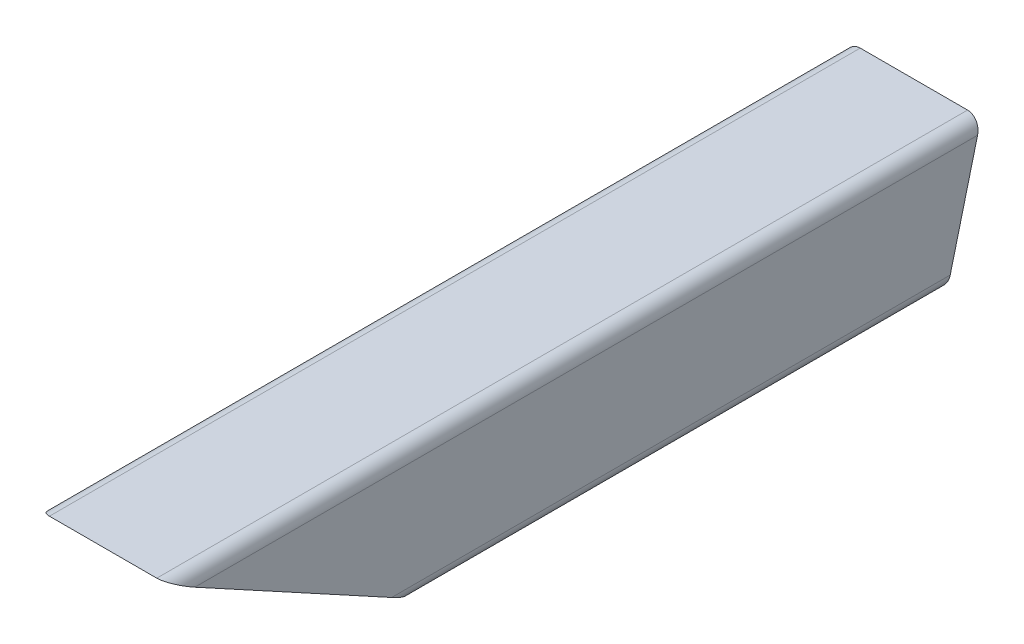
ISO-10303-21;
HEADER;
FILE_DESCRIPTION(('STEP AP214'),'2;1');
FILE_NAME('part.step','',(''),(''),'','','');
FILE_SCHEMA(('AUTOMOTIVE_DESIGN { 1 0 10303 214 1 1 1 1 }'));
ENDSEC;
DATA;
#1=APPLICATION_CONTEXT('core data for automotive mechanical design processes');
#2=APPLICATION_PROTOCOL_DEFINITION('international standard','automotive_design',2000,#1);
#3=PRODUCT_CONTEXT('',#1,'mechanical');
#4=PRODUCT('Part','Part','',(#3));
#5=PRODUCT_RELATED_PRODUCT_CATEGORY('part','',(#4));
#6=PRODUCT_DEFINITION_FORMATION('','',#4);
#7=PRODUCT_DEFINITION_CONTEXT('part definition',#1,'design');
#8=PRODUCT_DEFINITION('design','',#6,#7);
#9=PRODUCT_DEFINITION_SHAPE('','',#8);
#10=(LENGTH_UNIT() NAMED_UNIT(*) SI_UNIT(.MILLI.,.METRE.));
#11=(NAMED_UNIT(*) PLANE_ANGLE_UNIT() SI_UNIT($,.RADIAN.));
#12=(NAMED_UNIT(*) SI_UNIT($,.STERADIAN.) SOLID_ANGLE_UNIT());
#13=UNCERTAINTY_MEASURE_WITH_UNIT(LENGTH_MEASURE(1.E-05),#10,'distance_accuracy_value','');
#14=(GEOMETRIC_REPRESENTATION_CONTEXT(3) GLOBAL_UNCERTAINTY_ASSIGNED_CONTEXT((#13)) GLOBAL_UNIT_ASSIGNED_CONTEXT((#10,
#11,#12)) REPRESENTATION_CONTEXT('',''));
#15=CARTESIAN_POINT('',(0.,0.,0.));
#16=DIRECTION('',(0.,0.,1.));
#17=DIRECTION('',(1.,0.,0.));
#18=AXIS2_PLACEMENT_3D('',#15,#16,#17);
#19=CARTESIAN_POINT('',(-27.,-12.,-255.713394152729));
#20=DIRECTION('',(0.,0.,1.));
#21=DIRECTION('',(1.,0.,0.));
#22=AXIS2_PLACEMENT_3D('',#19,#20,#21);
#23=CYLINDRICAL_SURFACE('',#22,3.);
#24=CARTESIAN_POINT('',(-27.,-12.,-84.6805707036299));
#25=DIRECTION('',(0.,0.877983597106916,-0.478690717699018));
#26=DIRECTION('',(0.,0.478690717699018,0.877983597106916));
#27=AXIS2_PLACEMENT_3D('',#24,#25,#26);
#28=ELLIPSE('',#27,6.26709457501176,3.);
#29=CARTESIAN_POINT('',(-30.,-12.,-84.6805707036299));
#30=VERTEX_POINT('',#29);
#31=CARTESIAN_POINT('',(-27.,-15.,-90.182976942008));
#32=VERTEX_POINT('',#31);
#33=EDGE_CURVE('E48',#30,#32,#28,.F.);
#34=ORIENTED_EDGE('',*,*,#33,.F.);
#35=DIRECTION('',(0.,0.,1.));
#36=VECTOR('',#35,1.);
#37=CARTESIAN_POINT('',(-30.,-12.,-255.713394152729));
#38=LINE('',#37,#36);
#39=CARTESIAN_POINT('',(-30.,-11.9999999999994,-209.549945584766));
#40=VERTEX_POINT('',#39);
#41=EDGE_CURVE('E186',#40,#30,#38,.T.);
#42=ORIENTED_EDGE('',*,*,#41,.F.);
#43=CARTESIAN_POINT('',(-27.,-12.,-209.549945584765));
#44=DIRECTION('',(0.,-0.246998383489744,-0.969015891796132));
#45=DIRECTION('',(0.,-0.969015891796132,0.246998383489744));
#46=AXIS2_PLACEMENT_3D('',#43,#44,#45);
#47=ELLIPSE('',#46,3.09592445841039,3.);
#48=CARTESIAN_POINT('',(-27.,-14.9999999999993,-208.785257248132));
#49=VERTEX_POINT('',#48);
#50=EDGE_CURVE('E41',#40,#49,#47,.F.);
#51=ORIENTED_EDGE('',*,*,#50,.T.);
#52=DIRECTION('',(0.,0.,1.));
#53=VECTOR('',#52,1.);
#54=CARTESIAN_POINT('',(-27.,-15.,-255.713394152729));
#55=LINE('',#54,#53);
#56=EDGE_CURVE('E173',#49,#32,#55,.T.);
#57=ORIENTED_EDGE('',*,*,#56,.T.);
#58=EDGE_LOOP('',(#34,#42,#51,#57));
#59=FACE_BOUND('',#58,.T.);
#60=ADVANCED_FACE('F34',(#59),#23,.T.);
#61=CARTESIAN_POINT('',(-30.,12.,-255.713394152729));
#62=DIRECTION('',(-1.,0.,0.));
#63=DIRECTION('',(0.,0.,1.));
#64=AXIS2_PLACEMENT_3D('',#61,#62,#63);
#65=PLANE('',#64);
#66=DIRECTION('',(0.,0.478690717699018,0.877983597106916));
#67=VECTOR('',#66,1.);
#68=CARTESIAN_POINT('',(-30.,35.9133222671878,3.19895041116765));
#69=LINE('',#68,#67);
#70=CARTESIAN_POINT('',(-30.,11.9999999999999,-40.6613207966057));
#71=VERTEX_POINT('',#70);
#72=EDGE_CURVE('E165',#30,#71,#69,.T.);
#73=ORIENTED_EDGE('',*,*,#72,.T.);
#74=DIRECTION('',(0.,0.,1.));
#75=VECTOR('',#74,1.);
#76=CARTESIAN_POINT('',(-30.,12.,-255.713394152729));
#77=LINE('',#76,#75);
#78=CARTESIAN_POINT('',(-30.,12.0000000000005,-215.667452277835));
#79=VERTEX_POINT('',#78);
#80=EDGE_CURVE('E274',#79,#71,#77,.T.);
#81=ORIENTED_EDGE('',*,*,#80,.F.);
#82=DIRECTION('',(0.,-0.969015891796132,0.246998383489744));
#83=VECTOR('',#82,1.);
#84=CARTESIAN_POINT('',(-30.,21.5848103285134,-218.110583166855));
#85=LINE('',#84,#83);
#86=EDGE_CURVE('E212',#79,#40,#85,.T.);
#87=ORIENTED_EDGE('',*,*,#86,.T.);
#88=ORIENTED_EDGE('',*,*,#41,.T.);
#89=EDGE_LOOP('',(#73,#81,#87,#88));
#90=FACE_BOUND('',#89,.T.);
#91=ADVANCED_FACE('F292',(#90),#65,.T.);
#92=CARTESIAN_POINT('',(-27.,12.,-255.713394152729));
#93=DIRECTION('',(0.,0.,1.));
#94=DIRECTION('',(1.,0.,0.));
#95=AXIS2_PLACEMENT_3D('',#92,#93,#94);
#96=CYLINDRICAL_SURFACE('',#95,3.);
#97=CARTESIAN_POINT('',(-27.,12.,-40.6613207966055));
#98=DIRECTION('',(0.,0.877983597106916,-0.478690717699018));
#99=DIRECTION('',(0.,0.478690717699018,0.877983597106916));
#100=AXIS2_PLACEMENT_3D('',#97,#98,#99);
#101=ELLIPSE('',#100,6.26709457501175,3.);
#102=CARTESIAN_POINT('',(-27.,15.,-35.1589145582274));
#103=VERTEX_POINT('',#102);
#104=EDGE_CURVE('E247',#103,#71,#101,.F.);
#105=ORIENTED_EDGE('',*,*,#104,.F.);
#106=DIRECTION('',(0.,0.,1.));
#107=VECTOR('',#106,1.);
#108=CARTESIAN_POINT('',(-27.,15.,-255.713394152729));
#109=LINE('',#108,#107);
#110=CARTESIAN_POINT('',(-27.,15.0000000000005,-216.432140614469));
#111=VERTEX_POINT('',#110);
#112=EDGE_CURVE('E277',#111,#103,#109,.T.);
#113=ORIENTED_EDGE('',*,*,#112,.F.);
#114=CARTESIAN_POINT('',(-27.,12.,-215.667452277835));
#115=DIRECTION('',(0.,-0.246998383489744,-0.969015891796132));
#116=DIRECTION('',(0.,-0.969015891796132,0.246998383489744));
#117=AXIS2_PLACEMENT_3D('',#114,#115,#116);
#118=ELLIPSE('',#117,3.09592445841039,3.);
#119=EDGE_CURVE('E209',#111,#79,#118,.F.);
#120=ORIENTED_EDGE('',*,*,#119,.T.);
#121=ORIENTED_EDGE('',*,*,#80,.T.);
#122=EDGE_LOOP('',(#105,#113,#120,#121));
#123=FACE_BOUND('',#122,.T.);
#124=ADVANCED_FACE('F289',(#123),#96,.T.);
#125=CARTESIAN_POINT('',(-27.,15.,-255.713394152729));
#126=DIRECTION('',(0.,1.,0.));
#127=DIRECTION('',(0.,0.,1.));
#128=AXIS2_PLACEMENT_3D('',#125,#126,#127);
#129=PLANE('',#128);
#130=DIRECTION('',(-1.,0.,0.));
#131=VECTOR('',#130,1.);
#132=CARTESIAN_POINT('',(-27.,15.,-35.1589145582274));
#133=LINE('',#132,#131);
#134=CARTESIAN_POINT('',(-3.00000000000001,15.,-35.1589145582274));
#135=VERTEX_POINT('',#134);
#136=EDGE_CURVE('E245',#135,#103,#133,.T.);
#137=ORIENTED_EDGE('',*,*,#136,.F.);
#138=DIRECTION('',(0.,0.,1.));
#139=VECTOR('',#138,1.);
#140=CARTESIAN_POINT('',(-3.00000000000001,15.,-255.713394152729));
#141=LINE('',#140,#139);
#142=CARTESIAN_POINT('',(-3.00000000000004,15.0000000000005,-216.432140614469));
#143=VERTEX_POINT('',#142);
#144=EDGE_CURVE('E171',#143,#135,#141,.T.);
#145=ORIENTED_EDGE('',*,*,#144,.F.);
#146=DIRECTION('',(-1.,0.,0.));
#147=VECTOR('',#146,1.);
#148=CARTESIAN_POINT('',(-27.,15.,-216.432140614469));
#149=LINE('',#148,#147);
#150=EDGE_CURVE('E206',#143,#111,#149,.T.);
#151=ORIENTED_EDGE('',*,*,#150,.T.);
#152=ORIENTED_EDGE('',*,*,#112,.T.);
#153=EDGE_LOOP('',(#137,#145,#151,#152));
#154=FACE_BOUND('',#153,.T.);
#155=ADVANCED_FACE('F285',(#154),#129,.T.);
#156=CARTESIAN_POINT('',(-3.00000000000001,12.,-255.713394152729));
#157=DIRECTION('',(0.,0.,1.));
#158=DIRECTION('',(1.,0.,0.));
#159=AXIS2_PLACEMENT_3D('',#156,#157,#158);
#160=CYLINDRICAL_SURFACE('',#159,3.);
#161=CARTESIAN_POINT('',(-3.00000000000001,12.,-40.6613207966055));
#162=DIRECTION('',(0.,0.877983597106916,-0.478690717699018));
#163=DIRECTION('',(0.,0.478690717699018,0.877983597106916));
#164=AXIS2_PLACEMENT_3D('',#161,#162,#163);
#165=ELLIPSE('',#164,6.26709457501176,3.);
#166=CARTESIAN_POINT('',(0.,12.,-40.6613207966055));
#167=VERTEX_POINT('',#166);
#168=EDGE_CURVE('E153',#167,#135,#165,.F.);
#169=ORIENTED_EDGE('',*,*,#168,.F.);
#170=DIRECTION('',(0.,0.,1.));
#171=VECTOR('',#170,1.);
#172=CARTESIAN_POINT('',(0.,12.,-255.713394152729));
#173=LINE('',#172,#171);
#174=CARTESIAN_POINT('',(0.,12.0000000000005,-215.667452277835));
#175=VERTEX_POINT('',#174);
#176=EDGE_CURVE('E164',#175,#167,#173,.T.);
#177=ORIENTED_EDGE('',*,*,#176,.F.);
#178=CARTESIAN_POINT('',(-3.00000000000001,12.,-215.667452277835));
#179=DIRECTION('',(0.,-0.246998383489744,-0.969015891796132));
#180=DIRECTION('',(0.,-0.969015891796132,0.246998383489744));
#181=AXIS2_PLACEMENT_3D('',#178,#179,#180);
#182=ELLIPSE('',#181,3.09592445841039,3.);
#183=EDGE_CURVE('E203',#175,#143,#182,.F.);
#184=ORIENTED_EDGE('',*,*,#183,.T.);
#185=ORIENTED_EDGE('',*,*,#144,.T.);
#186=EDGE_LOOP('',(#169,#177,#184,#185));
#187=FACE_BOUND('',#186,.T.);
#188=ADVANCED_FACE('F282',(#187),#160,.T.);
#189=CARTESIAN_POINT('',(0.,12.,-255.713394152729));
#190=DIRECTION('',(1.,0.,0.));
#191=DIRECTION('',(0.,1.,0.));
#192=AXIS2_PLACEMENT_3D('',#189,#190,#191);
#193=PLANE('',#192);
#194=DIRECTION('',(0.,0.478690717699018,0.877983597106916));
#195=VECTOR('',#194,1.);
#196=CARTESIAN_POINT('',(0.,35.9133222671878,3.19895041116765));
#197=LINE('',#196,#195);
#198=CARTESIAN_POINT('',(0.,-12.0000000000001,-84.6805707036302));
#199=VERTEX_POINT('',#198);
#200=EDGE_CURVE('E146',#199,#167,#197,.T.);
#201=ORIENTED_EDGE('',*,*,#200,.F.);
#202=DIRECTION('',(0.,0.,1.));
#203=VECTOR('',#202,1.);
#204=CARTESIAN_POINT('',(0.,-12.,-255.713394152729));
#205=LINE('',#204,#203);
#206=CARTESIAN_POINT('',(0.,-11.9999999999994,-209.549945584766));
#207=VERTEX_POINT('',#206);
#208=EDGE_CURVE('E161',#207,#199,#205,.T.);
#209=ORIENTED_EDGE('',*,*,#208,.F.);
#210=DIRECTION('',(0.,0.969015891796132,-0.246998383489744));
#211=VECTOR('',#210,1.);
#212=CARTESIAN_POINT('',(0.,21.5848103285135,-218.110583166855));
#213=LINE('',#212,#211);
#214=EDGE_CURVE('E201',#207,#175,#213,.T.);
#215=ORIENTED_EDGE('',*,*,#214,.T.);
#216=ORIENTED_EDGE('',*,*,#176,.T.);
#217=EDGE_LOOP('',(#201,#209,#215,#216));
#218=FACE_BOUND('',#217,.T.);
#219=ADVANCED_FACE('F159',(#218),#193,.T.);
#220=CARTESIAN_POINT('',(-3.,-12.,-255.713394152729));
#221=DIRECTION('',(0.,0.,1.));
#222=DIRECTION('',(1.,0.,0.));
#223=AXIS2_PLACEMENT_3D('',#220,#221,#222);
#224=CYLINDRICAL_SURFACE('',#223,3.);
#225=CARTESIAN_POINT('',(-3.,-12.,-84.6805707036299));
#226=DIRECTION('',(0.,0.877983597106916,-0.478690717699018));
#227=DIRECTION('',(0.,0.478690717699018,0.877983597106916));
#228=AXIS2_PLACEMENT_3D('',#225,#226,#227);
#229=ELLIPSE('',#228,6.26709457501175,3.);
#230=CARTESIAN_POINT('',(-3.00000000000001,-15.,-90.182976942008));
#231=VERTEX_POINT('',#230);
#232=EDGE_CURVE('E143',#231,#199,#229,.F.);
#233=ORIENTED_EDGE('',*,*,#232,.F.);
#234=DIRECTION('',(0.,0.,1.));
#235=VECTOR('',#234,1.);
#236=CARTESIAN_POINT('',(-3.,-15.,-255.713394152729));
#237=LINE('',#236,#235);
#238=CARTESIAN_POINT('',(-3.,-15.,-208.785257248132));
#239=VERTEX_POINT('',#238);
#240=EDGE_CURVE('E169',#239,#231,#237,.T.);
#241=ORIENTED_EDGE('',*,*,#240,.F.);
#242=CARTESIAN_POINT('',(-3.,-12.,-209.549945584765));
#243=DIRECTION('',(0.,-0.246998383489744,-0.969015891796132));
#244=DIRECTION('',(0.,-0.969015891796132,0.246998383489744));
#245=AXIS2_PLACEMENT_3D('',#242,#243,#244);
#246=ELLIPSE('',#245,3.09592445841039,3.);
#247=EDGE_CURVE('E168',#239,#207,#246,.F.);
#248=ORIENTED_EDGE('',*,*,#247,.T.);
#249=ORIENTED_EDGE('',*,*,#208,.T.);
#250=EDGE_LOOP('',(#233,#241,#248,#249));
#251=FACE_BOUND('',#250,.T.);
#252=ADVANCED_FACE('F167',(#251),#224,.T.);
#253=CARTESIAN_POINT('',(-27.,-15.,-255.713394152729));
#254=DIRECTION('',(0.,-1.,0.));
#255=DIRECTION('',(1.,0.,0.));
#256=AXIS2_PLACEMENT_3D('',#253,#254,#255);
#257=PLANE('',#256);
#258=DIRECTION('',(1.,0.,0.));
#259=VECTOR('',#258,1.);
#260=CARTESIAN_POINT('',(-30.,-15.,-90.182976942008));
#261=LINE('',#260,#259);
#262=EDGE_CURVE('E148',#32,#231,#261,.T.);
#263=ORIENTED_EDGE('',*,*,#262,.F.);
#264=ORIENTED_EDGE('',*,*,#56,.F.);
#265=DIRECTION('',(1.,0.,0.));
#266=VECTOR('',#265,1.);
#267=CARTESIAN_POINT('',(-27.,-15.,-208.785257248132));
#268=LINE('',#267,#266);
#269=EDGE_CURVE('E182',#49,#239,#268,.T.);
#270=ORIENTED_EDGE('',*,*,#269,.T.);
#271=ORIENTED_EDGE('',*,*,#240,.T.);
#272=EDGE_LOOP('',(#263,#264,#270,#271));
#273=FACE_BOUND('',#272,.T.);
#274=ADVANCED_FACE('F221',(#273),#257,.T.);
#275=CARTESIAN_POINT('',(-26.,-11.,-255.713394152729));
#276=DIRECTION('',(0.,0.,1.));
#277=DIRECTION('',(1.,0.,0.));
#278=AXIS2_PLACEMENT_3D('',#275,#276,#277);
#279=CYLINDRICAL_SURFACE('',#278,2.);
#280=DIRECTION('',(0.,0.,1.));
#281=VECTOR('',#280,1.);
#282=CARTESIAN_POINT('',(-28.,-11.,-255.713394152729));
#283=LINE('',#282,#281);
#284=CARTESIAN_POINT('',(-28.,-10.9999999999994,-209.804841696977));
#285=VERTEX_POINT('',#284);
#286=CARTESIAN_POINT('',(-28.,-11.,-82.8464352908372));
#287=VERTEX_POINT('',#286);
#288=EDGE_CURVE('E179',#285,#287,#283,.T.);
#289=ORIENTED_EDGE('',*,*,#288,.T.);
#290=CARTESIAN_POINT('',(-26.,-11.,-82.8464352908372));
#291=DIRECTION('',(0.,0.877983597106916,-0.478690717699018));
#292=DIRECTION('',(0.,0.478690717699018,0.877983597106916));
#293=AXIS2_PLACEMENT_3D('',#290,#291,#292);
#294=ELLIPSE('',#293,4.17806305000784,2.);
#295=CARTESIAN_POINT('',(-26.,-13.,-86.5147061164226));
#296=VERTEX_POINT('',#295);
#297=EDGE_CURVE('E154',#287,#296,#294,.F.);
#298=ORIENTED_EDGE('',*,*,#297,.T.);
#299=DIRECTION('',(0.,0.,1.));
#300=VECTOR('',#299,1.);
#301=CARTESIAN_POINT('',(-26.,-13.,-255.713394152729));
#302=LINE('',#301,#300);
#303=CARTESIAN_POINT('',(-26.,-13.,-209.295049472554));
#304=VERTEX_POINT('',#303);
#305=EDGE_CURVE('E250',#304,#296,#302,.T.);
#306=ORIENTED_EDGE('',*,*,#305,.F.);
#307=CARTESIAN_POINT('',(-26.,-11.,-209.804841696977));
#308=DIRECTION('',(0.,-0.246998383489744,-0.969015891796132));
#309=DIRECTION('',(0.,-0.969015891796132,0.246998383489744));
#310=AXIS2_PLACEMENT_3D('',#307,#308,#309);
#311=ELLIPSE('',#310,2.06394963894026,2.);
#312=EDGE_CURVE('E196',#285,#304,#311,.F.);
#313=ORIENTED_EDGE('',*,*,#312,.F.);
#314=EDGE_LOOP('',(#289,#298,#306,#313));
#315=FACE_BOUND('',#314,.T.);
#316=ADVANCED_FACE('F309',(#315),#279,.F.);
#317=CARTESIAN_POINT('',(-28.,11.,-255.713394152729));
#318=DIRECTION('',(-1.,0.,0.));
#319=DIRECTION('',(0.,0.,1.));
#320=AXIS2_PLACEMENT_3D('',#317,#318,#319);
#321=PLANE('',#320);
#322=DIRECTION('',(0.,0.,1.));
#323=VECTOR('',#322,1.);
#324=CARTESIAN_POINT('',(-28.,11.,-255.713394152729));
#325=LINE('',#324,#323);
#326=CARTESIAN_POINT('',(-28.,11.0000000000005,-215.412556165624));
#327=VERTEX_POINT('',#326);
#328=CARTESIAN_POINT('',(-28.,11.,-42.4954562093982));
#329=VERTEX_POINT('',#328);
#330=EDGE_CURVE('E253',#327,#329,#325,.T.);
#331=ORIENTED_EDGE('',*,*,#330,.T.);
#332=DIRECTION('',(0.,-0.478690717699018,-0.877983597106916));
#333=VECTOR('',#332,1.);
#334=CARTESIAN_POINT('',(-28.,-78.6117889474425,-206.855611721607));
#335=LINE('',#334,#333);
#336=EDGE_CURVE('E239',#329,#287,#335,.T.);
#337=ORIENTED_EDGE('',*,*,#336,.T.);
#338=ORIENTED_EDGE('',*,*,#288,.F.);
#339=DIRECTION('',(0.,-0.969015891796132,0.246998383489744));
#340=VECTOR('',#339,1.);
#341=CARTESIAN_POINT('',(-28.,20.64581852996,-217.871237808006));
#342=LINE('',#341,#340);
#343=EDGE_CURVE('E194',#327,#285,#342,.T.);
#344=ORIENTED_EDGE('',*,*,#343,.F.);
#345=EDGE_LOOP('',(#331,#337,#338,#344));
#346=FACE_BOUND('',#345,.T.);
#347=ADVANCED_FACE('F313',(#346),#321,.F.);
#348=CARTESIAN_POINT('',(-26.,11.,-255.713394152729));
#349=DIRECTION('',(0.,0.,1.));
#350=DIRECTION('',(1.,0.,0.));
#351=AXIS2_PLACEMENT_3D('',#348,#349,#350);
#352=CYLINDRICAL_SURFACE('',#351,2.);
#353=DIRECTION('',(0.,0.,1.));
#354=VECTOR('',#353,1.);
#355=CARTESIAN_POINT('',(-26.,13.,-255.713394152729));
#356=LINE('',#355,#354);
#357=CARTESIAN_POINT('',(-26.,13.0000000000005,-215.922348390047));
#358=VERTEX_POINT('',#357);
#359=CARTESIAN_POINT('',(-26.,13.,-38.8271853838128));
#360=VERTEX_POINT('',#359);
#361=EDGE_CURVE('E256',#358,#360,#356,.T.);
#362=ORIENTED_EDGE('',*,*,#361,.T.);
#363=CARTESIAN_POINT('',(-26.,11.,-42.4954562093981));
#364=DIRECTION('',(0.,0.877983597106916,-0.478690717699018));
#365=DIRECTION('',(0.,0.478690717699018,0.877983597106916));
#366=AXIS2_PLACEMENT_3D('',#363,#364,#365);
#367=ELLIPSE('',#366,4.17806305000784,2.);
#368=EDGE_CURVE('E236',#360,#329,#367,.F.);
#369=ORIENTED_EDGE('',*,*,#368,.T.);
#370=ORIENTED_EDGE('',*,*,#330,.F.);
#371=CARTESIAN_POINT('',(-26.,11.,-215.412556165624));
#372=DIRECTION('',(0.,-0.246998383489744,-0.969015891796132));
#373=DIRECTION('',(0.,-0.969015891796132,0.246998383489744));
#374=AXIS2_PLACEMENT_3D('',#371,#372,#373);
#375=ELLIPSE('',#374,2.06394963894026,2.);
#376=EDGE_CURVE('E192',#358,#327,#375,.F.);
#377=ORIENTED_EDGE('',*,*,#376,.F.);
#378=EDGE_LOOP('',(#362,#369,#370,#377));
#379=FACE_BOUND('',#378,.T.);
#380=ADVANCED_FACE('F316',(#379),#352,.F.);
#381=CARTESIAN_POINT('',(-26.,13.,-255.713394152729));
#382=DIRECTION('',(0.,1.,0.));
#383=DIRECTION('',(0.,0.,1.));
#384=AXIS2_PLACEMENT_3D('',#381,#382,#383);
#385=PLANE('',#384);
#386=DIRECTION('',(0.,0.,1.));
#387=VECTOR('',#386,1.);
#388=CARTESIAN_POINT('',(-4.00000000000002,13.,-255.713394152729));
#389=LINE('',#388,#387);
#390=CARTESIAN_POINT('',(-4.00000000000003,13.0000000000005,-215.922348390047));
#391=VERTEX_POINT('',#390);
#392=CARTESIAN_POINT('',(-4.00000000000002,13.,-38.8271853838127));
#393=VERTEX_POINT('',#392);
#394=EDGE_CURVE('E259',#391,#393,#389,.T.);
#395=ORIENTED_EDGE('',*,*,#394,.T.);
#396=DIRECTION('',(-1.,0.,0.));
#397=VECTOR('',#396,1.);
#398=CARTESIAN_POINT('',(-26.,13.,-38.8271853838128));
#399=LINE('',#398,#397);
#400=EDGE_CURVE('E233',#393,#360,#399,.T.);
#401=ORIENTED_EDGE('',*,*,#400,.T.);
#402=ORIENTED_EDGE('',*,*,#361,.F.);
#403=DIRECTION('',(-1.,0.,0.));
#404=VECTOR('',#403,1.);
#405=CARTESIAN_POINT('',(-26.,13.,-215.922348390046));
#406=LINE('',#405,#404);
#407=EDGE_CURVE('E190',#391,#358,#406,.T.);
#408=ORIENTED_EDGE('',*,*,#407,.F.);
#409=EDGE_LOOP('',(#395,#401,#402,#408));
#410=FACE_BOUND('',#409,.T.);
#411=ADVANCED_FACE('F321',(#410),#385,.F.);
#412=CARTESIAN_POINT('',(-4.,11.,-255.713394152729));
#413=DIRECTION('',(0.,0.,1.));
#414=DIRECTION('',(1.,0.,0.));
#415=AXIS2_PLACEMENT_3D('',#412,#413,#414);
#416=CYLINDRICAL_SURFACE('',#415,2.);
#417=DIRECTION('',(0.,0.,1.));
#418=VECTOR('',#417,1.);
#419=CARTESIAN_POINT('',(-2.,11.,-255.713394152729));
#420=LINE('',#419,#418);
#421=CARTESIAN_POINT('',(-2.00000000000002,11.0000000000005,-215.412556165624));
#422=VERTEX_POINT('',#421);
#423=CARTESIAN_POINT('',(-2.,11.,-42.4954562093982));
#424=VERTEX_POINT('',#423);
#425=EDGE_CURVE('E262',#422,#424,#420,.T.);
#426=ORIENTED_EDGE('',*,*,#425,.T.);
#427=CARTESIAN_POINT('',(-4.,11.,-42.4954562093981));
#428=DIRECTION('',(0.,0.877983597106916,-0.478690717699018));
#429=DIRECTION('',(0.,0.478690717699018,0.877983597106916));
#430=AXIS2_PLACEMENT_3D('',#427,#428,#429);
#431=ELLIPSE('',#430,4.17806305000784,2.);
#432=EDGE_CURVE('E230',#424,#393,#431,.F.);
#433=ORIENTED_EDGE('',*,*,#432,.T.);
#434=ORIENTED_EDGE('',*,*,#394,.F.);
#435=CARTESIAN_POINT('',(-4.,11.,-215.412556165624));
#436=DIRECTION('',(0.,-0.246998383489744,-0.969015891796132));
#437=DIRECTION('',(0.,-0.969015891796132,0.246998383489744));
#438=AXIS2_PLACEMENT_3D('',#435,#436,#437);
#439=ELLIPSE('',#438,2.06394963894026,2.);
#440=EDGE_CURVE('E188',#422,#391,#439,.F.);
#441=ORIENTED_EDGE('',*,*,#440,.F.);
#442=EDGE_LOOP('',(#426,#433,#434,#441));
#443=FACE_BOUND('',#442,.T.);
#444=ADVANCED_FACE('F324',(#443),#416,.F.);
#445=CARTESIAN_POINT('',(-2.,11.,-255.713394152729));
#446=DIRECTION('',(1.,0.,0.));
#447=DIRECTION('',(0.,0.,-1.));
#448=AXIS2_PLACEMENT_3D('',#445,#446,#447);
#449=PLANE('',#448);
#450=DIRECTION('',(0.,0.,1.));
#451=VECTOR('',#450,1.);
#452=CARTESIAN_POINT('',(-2.,-11.,-255.713394152729));
#453=LINE('',#452,#451);
#454=CARTESIAN_POINT('',(-2.00000000000002,-10.9999999999994,-209.804841696977));
#455=VERTEX_POINT('',#454);
#456=CARTESIAN_POINT('',(-2.,-11.,-82.8464352908372));
#457=VERTEX_POINT('',#456);
#458=EDGE_CURVE('E265',#455,#457,#453,.T.);
#459=ORIENTED_EDGE('',*,*,#458,.T.);
#460=DIRECTION('',(0.,0.478690717699018,0.877983597106916));
#461=VECTOR('',#460,1.);
#462=CARTESIAN_POINT('',(-2.,-78.6117889474425,-206.855611721607));
#463=LINE('',#462,#461);
#464=EDGE_CURVE('E223',#457,#424,#463,.T.);
#465=ORIENTED_EDGE('',*,*,#464,.T.);
#466=ORIENTED_EDGE('',*,*,#425,.F.);
#467=DIRECTION('',(0.,0.969015891796132,-0.246998383489744));
#468=VECTOR('',#467,1.);
#469=CARTESIAN_POINT('',(-2.,20.64581852996,-217.871237808006));
#470=LINE('',#469,#468);
#471=EDGE_CURVE('E185',#455,#422,#470,.T.);
#472=ORIENTED_EDGE('',*,*,#471,.F.);
#473=EDGE_LOOP('',(#459,#465,#466,#472));
#474=FACE_BOUND('',#473,.T.);
#475=ADVANCED_FACE('F328',(#474),#449,.F.);
#476=CARTESIAN_POINT('',(-4.,-11.,-255.713394152729));
#477=DIRECTION('',(0.,0.,1.));
#478=DIRECTION('',(1.,0.,0.));
#479=AXIS2_PLACEMENT_3D('',#476,#477,#478);
#480=CYLINDRICAL_SURFACE('',#479,2.);
#481=DIRECTION('',(0.,0.,1.));
#482=VECTOR('',#481,1.);
#483=CARTESIAN_POINT('',(-4.00000000000002,-13.,-255.713394152729));
#484=LINE('',#483,#482);
#485=CARTESIAN_POINT('',(-4.00000000000003,-12.9999999999993,-209.295049472554));
#486=VERTEX_POINT('',#485);
#487=CARTESIAN_POINT('',(-4.00000000000002,-13.,-86.5147061164226));
#488=VERTEX_POINT('',#487);
#489=EDGE_CURVE('E268',#486,#488,#484,.T.);
#490=ORIENTED_EDGE('',*,*,#489,.T.);
#491=CARTESIAN_POINT('',(-4.,-11.,-82.8464352908372));
#492=DIRECTION('',(0.,0.877983597106916,-0.478690717699018));
#493=DIRECTION('',(0.,0.478690717699018,0.877983597106916));
#494=AXIS2_PLACEMENT_3D('',#491,#492,#493);
#495=ELLIPSE('',#494,4.17806305000784,2.);
#496=EDGE_CURVE('E56',#488,#457,#495,.F.);
#497=ORIENTED_EDGE('',*,*,#496,.T.);
#498=ORIENTED_EDGE('',*,*,#458,.F.);
#499=CARTESIAN_POINT('',(-4.,-11.,-209.804841696977));
#500=DIRECTION('',(0.,-0.246998383489744,-0.969015891796132));
#501=DIRECTION('',(0.,-0.969015891796132,0.246998383489744));
#502=AXIS2_PLACEMENT_3D('',#499,#500,#501);
#503=ELLIPSE('',#502,2.06394963894026,2.);
#504=EDGE_CURVE('E183',#486,#455,#503,.F.);
#505=ORIENTED_EDGE('',*,*,#504,.F.);
#506=EDGE_LOOP('',(#490,#497,#498,#505));
#507=FACE_BOUND('',#506,.T.);
#508=ADVANCED_FACE('F307',(#507),#480,.F.);
#509=CARTESIAN_POINT('',(-26.,-13.,-255.713394152729));
#510=DIRECTION('',(0.,-1.,0.));
#511=DIRECTION('',(0.,0.,-1.));
#512=AXIS2_PLACEMENT_3D('',#509,#510,#511);
#513=PLANE('',#512);
#514=ORIENTED_EDGE('',*,*,#305,.T.);
#515=DIRECTION('',(1.,0.,0.));
#516=VECTOR('',#515,1.);
#517=CARTESIAN_POINT('',(-26.,-13.,-86.5147061164226));
#518=LINE('',#517,#516);
#519=EDGE_CURVE('E11',#296,#488,#518,.T.);
#520=ORIENTED_EDGE('',*,*,#519,.T.);
#521=ORIENTED_EDGE('',*,*,#489,.F.);
#522=DIRECTION('',(1.,0.,0.));
#523=VECTOR('',#522,1.);
#524=CARTESIAN_POINT('',(-26.,-13.,-209.295049472554));
#525=LINE('',#524,#523);
#526=EDGE_CURVE('E180',#304,#486,#525,.T.);
#527=ORIENTED_EDGE('',*,*,#526,.F.);
#528=EDGE_LOOP('',(#514,#520,#521,#527));
#529=FACE_BOUND('',#528,.T.);
#530=ADVANCED_FACE('F296',(#529),#513,.F.);
#531=CARTESIAN_POINT('',(-30.,15.0000000000005,-216.432140614469));
#532=DIRECTION('',(0.,-0.246998383489744,-0.969015891796132));
#533=DIRECTION('',(0.,-0.969015891796132,0.246998383489744));
#534=AXIS2_PLACEMENT_3D('',#531,#532,#533);
#535=PLANE('',#534);
#536=ORIENTED_EDGE('',*,*,#247,.F.);
#537=ORIENTED_EDGE('',*,*,#269,.F.);
#538=ORIENTED_EDGE('',*,*,#50,.F.);
#539=ORIENTED_EDGE('',*,*,#86,.F.);
#540=ORIENTED_EDGE('',*,*,#119,.F.);
#541=ORIENTED_EDGE('',*,*,#150,.F.);
#542=ORIENTED_EDGE('',*,*,#183,.F.);
#543=ORIENTED_EDGE('',*,*,#214,.F.);
#544=EDGE_LOOP('',(#536,#537,#538,#539,#540,#541,#542,#543));
#545=FACE_BOUND('',#544,.T.);
#546=ORIENTED_EDGE('',*,*,#526,.T.);
#547=ORIENTED_EDGE('',*,*,#504,.T.);
#548=ORIENTED_EDGE('',*,*,#471,.T.);
#549=ORIENTED_EDGE('',*,*,#440,.T.);
#550=ORIENTED_EDGE('',*,*,#407,.T.);
#551=ORIENTED_EDGE('',*,*,#376,.T.);
#552=ORIENTED_EDGE('',*,*,#343,.T.);
#553=ORIENTED_EDGE('',*,*,#312,.T.);
#554=EDGE_LOOP('',(#546,#547,#548,#549,#550,#551,#552,#553));
#555=FACE_BOUND('',#554,.T.);
#556=ADVANCED_FACE('F293',(#545,#555),#535,.T.);
#557=CARTESIAN_POINT('',(-30.,35.9133222671878,3.19895041116765));
#558=DIRECTION('',(0.,0.877983597106916,-0.478690717699018));
#559=DIRECTION('',(0.,0.478690717699018,0.877983597106916));
#560=AXIS2_PLACEMENT_3D('',#557,#558,#559);
#561=PLANE('',#560);
#562=ORIENTED_EDGE('',*,*,#33,.T.);
#563=ORIENTED_EDGE('',*,*,#262,.T.);
#564=ORIENTED_EDGE('',*,*,#232,.T.);
#565=ORIENTED_EDGE('',*,*,#200,.T.);
#566=ORIENTED_EDGE('',*,*,#168,.T.);
#567=ORIENTED_EDGE('',*,*,#136,.T.);
#568=ORIENTED_EDGE('',*,*,#104,.T.);
#569=ORIENTED_EDGE('',*,*,#72,.F.);
#570=EDGE_LOOP('',(#562,#563,#564,#565,#566,#567,#568,#569));
#571=FACE_BOUND('',#570,.T.);
#572=ORIENTED_EDGE('',*,*,#336,.F.);
#573=ORIENTED_EDGE('',*,*,#368,.F.);
#574=ORIENTED_EDGE('',*,*,#400,.F.);
#575=ORIENTED_EDGE('',*,*,#432,.F.);
#576=ORIENTED_EDGE('',*,*,#464,.F.);
#577=ORIENTED_EDGE('',*,*,#496,.F.);
#578=ORIENTED_EDGE('',*,*,#519,.F.);
#579=ORIENTED_EDGE('',*,*,#297,.F.);
#580=EDGE_LOOP('',(#572,#573,#574,#575,#576,#577,#578,#579));
#581=FACE_BOUND('',#580,.T.);
#582=ADVANCED_FACE('F145',(#571,#581),#561,.F.);
#583=CLOSED_SHELL('',(#60,#91,#124,#155,#188,#219,#252,#274,#316,#347,#380,#411,#444,#475,#508,
#530,#556,#582));
#584=MANIFOLD_SOLID_BREP('B2',#583);
#585=ADVANCED_BREP_SHAPE_REPRESENTATION('',(#18,#584),#14);
#586=SHAPE_DEFINITION_REPRESENTATION(#9,#585);
ENDSEC;
END-ISO-10303-21;
